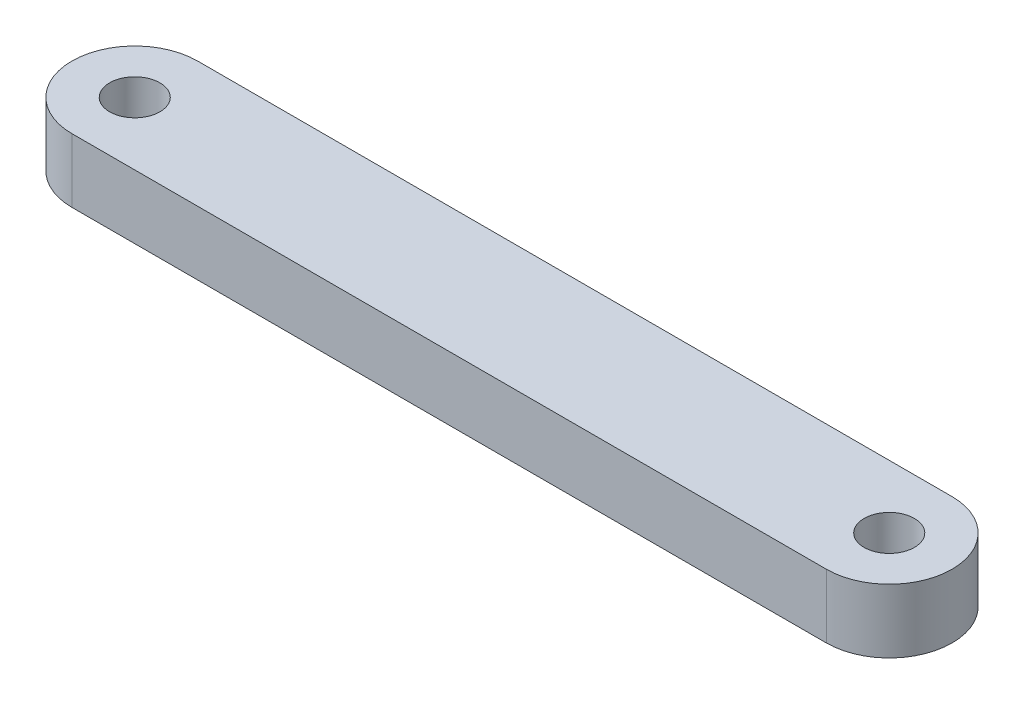
ISO-10303-21;
HEADER;
FILE_DESCRIPTION(('STEP AP214'),'2;1');
FILE_NAME('part.step','',(''),(''),'','','');
FILE_SCHEMA(('AUTOMOTIVE_DESIGN { 1 0 10303 214 1 1 1 1 }'));
ENDSEC;
DATA;
#1=APPLICATION_CONTEXT('core data for automotive mechanical design processes');
#2=APPLICATION_PROTOCOL_DEFINITION('international standard','automotive_design',2000,#1);
#3=PRODUCT_CONTEXT('',#1,'mechanical');
#4=PRODUCT('Part','Part','',(#3));
#5=PRODUCT_RELATED_PRODUCT_CATEGORY('part','',(#4));
#6=PRODUCT_DEFINITION_FORMATION('','',#4);
#7=PRODUCT_DEFINITION_CONTEXT('part definition',#1,'design');
#8=PRODUCT_DEFINITION('design','',#6,#7);
#9=PRODUCT_DEFINITION_SHAPE('','',#8);
#10=(LENGTH_UNIT() NAMED_UNIT(*) SI_UNIT(.MILLI.,.METRE.));
#11=(NAMED_UNIT(*) PLANE_ANGLE_UNIT() SI_UNIT($,.RADIAN.));
#12=(NAMED_UNIT(*) SI_UNIT($,.STERADIAN.) SOLID_ANGLE_UNIT());
#13=UNCERTAINTY_MEASURE_WITH_UNIT(LENGTH_MEASURE(1.E-05),#10,'distance_accuracy_value','');
#14=(GEOMETRIC_REPRESENTATION_CONTEXT(3) GLOBAL_UNCERTAINTY_ASSIGNED_CONTEXT((#13)) GLOBAL_UNIT_ASSIGNED_CONTEXT((#10,
#11,#12)) REPRESENTATION_CONTEXT('',''));
#15=CARTESIAN_POINT('',(0.,0.,0.));
#16=DIRECTION('',(0.,0.,1.));
#17=DIRECTION('',(1.,0.,0.));
#18=AXIS2_PLACEMENT_3D('',#15,#16,#17);
#19=CARTESIAN_POINT('',(15.,2.54,0.));
#20=DIRECTION('',(0.,-1.,0.));
#21=DIRECTION('',(0.,0.,-1.));
#22=AXIS2_PLACEMENT_3D('',#19,#20,#21);
#23=CYLINDRICAL_SURFACE('',#22,2.5);
#24=CARTESIAN_POINT('',(15.,0.,0.));
#25=DIRECTION('',(0.,1.,0.));
#26=DIRECTION('',(0.,0.,-1.));
#27=AXIS2_PLACEMENT_3D('',#24,#25,#26);
#28=CIRCLE('',#27,2.5);
#29=CARTESIAN_POINT('',(15.,0.,2.5));
#30=VERTEX_POINT('',#29);
#31=CARTESIAN_POINT('',(15.,0.,-2.5));
#32=VERTEX_POINT('',#31);
#33=EDGE_CURVE('E105',#30,#32,#28,.T.);
#34=ORIENTED_EDGE('',*,*,#33,.T.);
#35=DIRECTION('',(0.,-1.,0.));
#36=VECTOR('',#35,1.);
#37=CARTESIAN_POINT('',(15.,2.54,-2.5));
#38=LINE('',#37,#36);
#39=CARTESIAN_POINT('',(15.,2.54,-2.5));
#40=VERTEX_POINT('',#39);
#41=EDGE_CURVE('E11',#40,#32,#38,.T.);
#42=ORIENTED_EDGE('',*,*,#41,.F.);
#43=CARTESIAN_POINT('',(15.,2.54,0.));
#44=DIRECTION('',(0.,1.,0.));
#45=DIRECTION('',(0.,0.,-1.));
#46=AXIS2_PLACEMENT_3D('',#43,#44,#45);
#47=CIRCLE('',#46,2.5);
#48=CARTESIAN_POINT('',(15.,2.54,2.5));
#49=VERTEX_POINT('',#48);
#50=EDGE_CURVE('E92',#49,#40,#47,.T.);
#51=ORIENTED_EDGE('',*,*,#50,.F.);
#52=DIRECTION('',(0.,-1.,0.));
#53=VECTOR('',#52,1.);
#54=CARTESIAN_POINT('',(15.,2.54,2.5));
#55=LINE('',#54,#53);
#56=EDGE_CURVE('E101',#49,#30,#55,.T.);
#57=ORIENTED_EDGE('',*,*,#56,.T.);
#58=EDGE_LOOP('',(#34,#42,#51,#57));
#59=FACE_BOUND('',#58,.T.);
#60=ADVANCED_FACE('F39',(#59),#23,.T.);
#61=CARTESIAN_POINT('',(-15.,2.54,-2.5));
#62=DIRECTION('',(0.,0.,1.));
#63=DIRECTION('',(1.,0.,0.));
#64=AXIS2_PLACEMENT_3D('',#61,#62,#63);
#65=PLANE('',#64);
#66=DIRECTION('',(-1.,0.,0.));
#67=VECTOR('',#66,1.);
#68=CARTESIAN_POINT('',(-15.,0.,-2.5));
#69=LINE('',#68,#67);
#70=CARTESIAN_POINT('',(-15.,0.,-2.5));
#71=VERTEX_POINT('',#70);
#72=EDGE_CURVE('E96',#32,#71,#69,.T.);
#73=ORIENTED_EDGE('',*,*,#72,.T.);
#74=DIRECTION('',(0.,-1.,0.));
#75=VECTOR('',#74,1.);
#76=CARTESIAN_POINT('',(-15.,2.54,-2.5));
#77=LINE('',#76,#75);
#78=CARTESIAN_POINT('',(-15.,2.54,-2.5));
#79=VERTEX_POINT('',#78);
#80=EDGE_CURVE('E48',#79,#71,#77,.T.);
#81=ORIENTED_EDGE('',*,*,#80,.F.);
#82=DIRECTION('',(-1.,0.,0.));
#83=VECTOR('',#82,1.);
#84=CARTESIAN_POINT('',(-15.,2.54,-2.5));
#85=LINE('',#84,#83);
#86=EDGE_CURVE('E87',#40,#79,#85,.T.);
#87=ORIENTED_EDGE('',*,*,#86,.F.);
#88=ORIENTED_EDGE('',*,*,#41,.T.);
#89=EDGE_LOOP('',(#73,#81,#87,#88));
#90=FACE_BOUND('',#89,.T.);
#91=ADVANCED_FACE('F95',(#90),#65,.F.);
#92=CARTESIAN_POINT('',(-15.,2.54,0.));
#93=DIRECTION('',(0.,-1.,0.));
#94=DIRECTION('',(0.,0.,-1.));
#95=AXIS2_PLACEMENT_3D('',#92,#93,#94);
#96=CYLINDRICAL_SURFACE('',#95,2.5);
#97=CARTESIAN_POINT('',(-15.,0.,0.));
#98=DIRECTION('',(0.,1.,0.));
#99=DIRECTION('',(0.,0.,1.));
#100=AXIS2_PLACEMENT_3D('',#97,#98,#99);
#101=CIRCLE('',#100,2.5);
#102=CARTESIAN_POINT('',(-15.,0.,2.5));
#103=VERTEX_POINT('',#102);
#104=EDGE_CURVE('E74',#71,#103,#101,.T.);
#105=ORIENTED_EDGE('',*,*,#104,.T.);
#106=DIRECTION('',(0.,-1.,0.));
#107=VECTOR('',#106,1.);
#108=CARTESIAN_POINT('',(-15.,2.54,2.5));
#109=LINE('',#108,#107);
#110=CARTESIAN_POINT('',(-15.,2.54,2.5));
#111=VERTEX_POINT('',#110);
#112=EDGE_CURVE('E97',#111,#103,#109,.T.);
#113=ORIENTED_EDGE('',*,*,#112,.F.);
#114=CARTESIAN_POINT('',(-15.,2.54,0.));
#115=DIRECTION('',(0.,1.,0.));
#116=DIRECTION('',(0.,0.,1.));
#117=AXIS2_PLACEMENT_3D('',#114,#115,#116);
#118=CIRCLE('',#117,2.5);
#119=EDGE_CURVE('E90',#79,#111,#118,.T.);
#120=ORIENTED_EDGE('',*,*,#119,.F.);
#121=ORIENTED_EDGE('',*,*,#80,.T.);
#122=EDGE_LOOP('',(#105,#113,#120,#121));
#123=FACE_BOUND('',#122,.T.);
#124=ADVANCED_FACE('F99',(#123),#96,.T.);
#125=CARTESIAN_POINT('',(-15.,2.54,2.5));
#126=DIRECTION('',(0.,0.,-1.));
#127=DIRECTION('',(-1.,0.,0.));
#128=AXIS2_PLACEMENT_3D('',#125,#126,#127);
#129=PLANE('',#128);
#130=DIRECTION('',(1.,0.,0.));
#131=VECTOR('',#130,1.);
#132=CARTESIAN_POINT('',(-15.,0.,2.5));
#133=LINE('',#132,#131);
#134=EDGE_CURVE('E80',#103,#30,#133,.T.);
#135=ORIENTED_EDGE('',*,*,#134,.T.);
#136=ORIENTED_EDGE('',*,*,#56,.F.);
#137=DIRECTION('',(1.,0.,0.));
#138=VECTOR('',#137,1.);
#139=CARTESIAN_POINT('',(-15.,2.54,2.5));
#140=LINE('',#139,#138);
#141=EDGE_CURVE('E57',#111,#49,#140,.T.);
#142=ORIENTED_EDGE('',*,*,#141,.F.);
#143=ORIENTED_EDGE('',*,*,#112,.T.);
#144=EDGE_LOOP('',(#135,#136,#142,#143));
#145=FACE_BOUND('',#144,.T.);
#146=ADVANCED_FACE('F131',(#145),#129,.F.);
#147=CARTESIAN_POINT('',(15.,2.54,0.));
#148=DIRECTION('',(0.,-1.,0.));
#149=DIRECTION('',(0.,0.,-1.));
#150=AXIS2_PLACEMENT_3D('',#147,#148,#149);
#151=PLANE('',#150);
#152=CARTESIAN_POINT('',(-15.,2.54,0.));
#153=DIRECTION('',(0.,1.,0.));
#154=DIRECTION('',(0.,0.,1.));
#155=AXIS2_PLACEMENT_3D('',#152,#153,#154);
#156=CIRCLE('',#155,1.);
#157=CARTESIAN_POINT('',(-15.,2.54,1.));
#158=VERTEX_POINT('',#157);
#159=EDGE_CURVE('E114',#158,#158,#156,.T.);
#160=ORIENTED_EDGE('',*,*,#159,.F.);
#161=EDGE_LOOP('',(#160));
#162=FACE_BOUND('',#161,.T.);
#163=CARTESIAN_POINT('',(15.,2.54,0.));
#164=DIRECTION('',(0.,1.,0.));
#165=DIRECTION('',(0.,0.,-1.));
#166=AXIS2_PLACEMENT_3D('',#163,#164,#165);
#167=CIRCLE('',#166,1.);
#168=CARTESIAN_POINT('',(15.,2.54,-1.));
#169=VERTEX_POINT('',#168);
#170=EDGE_CURVE('E119',#169,#169,#167,.T.);
#171=ORIENTED_EDGE('',*,*,#170,.F.);
#172=EDGE_LOOP('',(#171));
#173=FACE_BOUND('',#172,.T.);
#174=ORIENTED_EDGE('',*,*,#50,.T.);
#175=ORIENTED_EDGE('',*,*,#86,.T.);
#176=ORIENTED_EDGE('',*,*,#119,.T.);
#177=ORIENTED_EDGE('',*,*,#141,.T.);
#178=EDGE_LOOP('',(#174,#175,#176,#177));
#179=FACE_BOUND('',#178,.T.);
#180=ADVANCED_FACE('F88',(#162,#173,#179),#151,.F.);
#181=CARTESIAN_POINT('',(15.,0.,0.));
#182=DIRECTION('',(0.,-1.,0.));
#183=DIRECTION('',(0.,0.,-1.));
#184=AXIS2_PLACEMENT_3D('',#181,#182,#183);
#185=PLANE('',#184);
#186=CARTESIAN_POINT('',(-15.,0.,0.));
#187=DIRECTION('',(0.,-1.,0.));
#188=DIRECTION('',(0.,0.,-1.));
#189=AXIS2_PLACEMENT_3D('',#186,#187,#188);
#190=CIRCLE('',#189,1.);
#191=CARTESIAN_POINT('',(-15.,0.,-1.));
#192=VERTEX_POINT('',#191);
#193=EDGE_CURVE('E42',#192,#192,#190,.T.);
#194=ORIENTED_EDGE('',*,*,#193,.F.);
#195=EDGE_LOOP('',(#194));
#196=FACE_BOUND('',#195,.T.);
#197=CARTESIAN_POINT('',(15.,0.,0.));
#198=DIRECTION('',(0.,-1.,0.));
#199=DIRECTION('',(0.,0.,-1.));
#200=AXIS2_PLACEMENT_3D('',#197,#198,#199);
#201=CIRCLE('',#200,1.);
#202=CARTESIAN_POINT('',(15.,0.,-1.));
#203=VERTEX_POINT('',#202);
#204=EDGE_CURVE('E112',#203,#203,#201,.T.);
#205=ORIENTED_EDGE('',*,*,#204,.F.);
#206=EDGE_LOOP('',(#205));
#207=FACE_BOUND('',#206,.T.);
#208=ORIENTED_EDGE('',*,*,#33,.F.);
#209=ORIENTED_EDGE('',*,*,#134,.F.);
#210=ORIENTED_EDGE('',*,*,#104,.F.);
#211=ORIENTED_EDGE('',*,*,#72,.F.);
#212=EDGE_LOOP('',(#208,#209,#210,#211));
#213=FACE_BOUND('',#212,.T.);
#214=ADVANCED_FACE('F130',(#196,#207,#213),#185,.T.);
#215=CARTESIAN_POINT('',(15.,-1.2E-05,0.));
#216=DIRECTION('',(0.,1.,0.));
#217=DIRECTION('',(0.,0.,1.));
#218=AXIS2_PLACEMENT_3D('',#215,#216,#217);
#219=CYLINDRICAL_SURFACE('',#218,1.);
#220=ORIENTED_EDGE('',*,*,#204,.T.);
#221=EDGE_LOOP('',(#220));
#222=FACE_BOUND('',#221,.T.);
#223=ORIENTED_EDGE('',*,*,#170,.T.);
#224=EDGE_LOOP('',(#223));
#225=FACE_BOUND('',#224,.T.);
#226=ADVANCED_FACE('F127',(#222,#225),#219,.F.);
#227=CARTESIAN_POINT('',(-15.,-1.2E-05,0.));
#228=DIRECTION('',(0.,1.,0.));
#229=DIRECTION('',(0.,0.,1.));
#230=AXIS2_PLACEMENT_3D('',#227,#228,#229);
#231=CYLINDRICAL_SURFACE('',#230,1.);
#232=ORIENTED_EDGE('',*,*,#193,.T.);
#233=EDGE_LOOP('',(#232));
#234=FACE_BOUND('',#233,.T.);
#235=ORIENTED_EDGE('',*,*,#159,.T.);
#236=EDGE_LOOP('',(#235));
#237=FACE_BOUND('',#236,.T.);
#238=ADVANCED_FACE('F180',(#234,#237),#231,.F.);
#239=CLOSED_SHELL('',(#60,#91,#124,#146,#180,#214,#226,#238));
#240=MANIFOLD_SOLID_BREP('B2',#239);
#241=ADVANCED_BREP_SHAPE_REPRESENTATION('',(#18,#240),#14);
#242=SHAPE_DEFINITION_REPRESENTATION(#9,#241);
ENDSEC;
END-ISO-10303-21;
